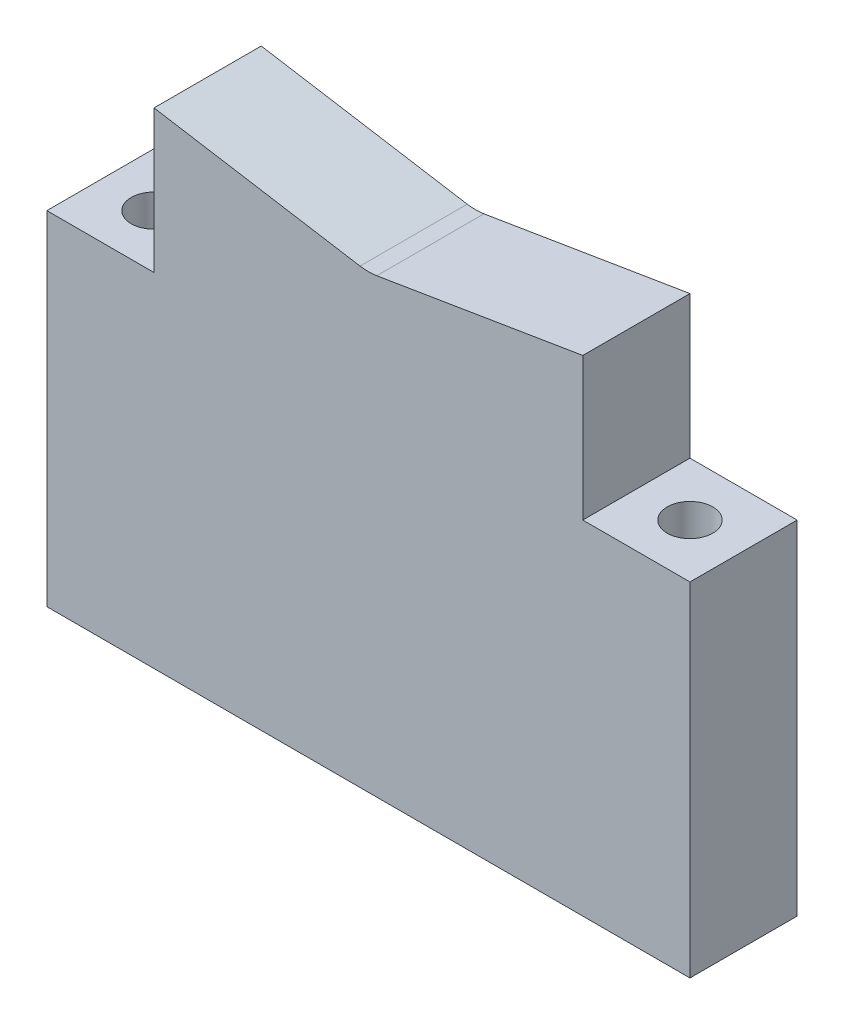
ISO-10303-21;
HEADER;
FILE_DESCRIPTION(('STEP AP214'),'2;1');
FILE_NAME('part.step','',(''),(''),'','','');
FILE_SCHEMA(('AUTOMOTIVE_DESIGN { 1 0 10303 214 1 1 1 1 }'));
ENDSEC;
DATA;
#1=APPLICATION_CONTEXT('core data for automotive mechanical design processes');
#2=APPLICATION_PROTOCOL_DEFINITION('international standard','automotive_design',2000,#1);
#3=PRODUCT_CONTEXT('',#1,'mechanical');
#4=PRODUCT('Part','Part','',(#3));
#5=PRODUCT_RELATED_PRODUCT_CATEGORY('part','',(#4));
#6=PRODUCT_DEFINITION_FORMATION('','',#4);
#7=PRODUCT_DEFINITION_CONTEXT('part definition',#1,'design');
#8=PRODUCT_DEFINITION('design','',#6,#7);
#9=PRODUCT_DEFINITION_SHAPE('','',#8);
#10=(LENGTH_UNIT() NAMED_UNIT(*) SI_UNIT(.MILLI.,.METRE.));
#11=(NAMED_UNIT(*) PLANE_ANGLE_UNIT() SI_UNIT($,.RADIAN.));
#12=(NAMED_UNIT(*) SI_UNIT($,.STERADIAN.) SOLID_ANGLE_UNIT());
#13=UNCERTAINTY_MEASURE_WITH_UNIT(LENGTH_MEASURE(1.E-05),#10,'distance_accuracy_value','');
#14=(GEOMETRIC_REPRESENTATION_CONTEXT(3) GLOBAL_UNCERTAINTY_ASSIGNED_CONTEXT((#13)) GLOBAL_UNIT_ASSIGNED_CONTEXT((#10,
#11,#12)) REPRESENTATION_CONTEXT('',''));
#15=CARTESIAN_POINT('',(0.,0.,0.));
#16=DIRECTION('',(0.,0.,1.));
#17=DIRECTION('',(1.,0.,0.));
#18=AXIS2_PLACEMENT_3D('',#15,#16,#17);
#19=CARTESIAN_POINT('',(31.75,0.,15.875));
#20=DIRECTION('',(1.,0.,0.));
#21=DIRECTION('',(0.,0.,-1.));
#22=AXIS2_PLACEMENT_3D('',#19,#20,#21);
#23=PLANE('',#22);
#24=DIRECTION('',(0.,-1.,0.));
#25=VECTOR('',#24,1.);
#26=CARTESIAN_POINT('',(31.75,0.,0.));
#27=LINE('',#26,#25);
#28=CARTESIAN_POINT('',(31.7500000000002,40.1622721729668,0.));
#29=VERTEX_POINT('',#28);
#30=CARTESIAN_POINT('',(31.75,19.05,0.));
#31=VERTEX_POINT('',#30);
#32=EDGE_CURVE('E123',#29,#31,#27,.T.);
#33=ORIENTED_EDGE('',*,*,#32,.F.);
#34=DIRECTION('',(0.,0.,-1.));
#35=VECTOR('',#34,1.);
#36=CARTESIAN_POINT('',(31.7500000000002,40.1622721729668,15.875));
#37=LINE('',#36,#35);
#38=CARTESIAN_POINT('',(31.7500000000002,40.1622721729668,15.875));
#39=VERTEX_POINT('',#38);
#40=EDGE_CURVE('E112',#39,#29,#37,.T.);
#41=ORIENTED_EDGE('',*,*,#40,.F.);
#42=DIRECTION('',(0.,-1.,0.));
#43=VECTOR('',#42,1.);
#44=CARTESIAN_POINT('',(31.75,0.,15.875));
#45=LINE('',#44,#43);
#46=CARTESIAN_POINT('',(31.75,19.05,15.875));
#47=VERTEX_POINT('',#46);
#48=EDGE_CURVE('E118',#39,#47,#45,.T.);
#49=ORIENTED_EDGE('',*,*,#48,.T.);
#50=DIRECTION('',(0.,0.,-1.));
#51=VECTOR('',#50,1.);
#52=CARTESIAN_POINT('',(31.75,19.05,15.875));
#53=LINE('',#52,#51);
#54=EDGE_CURVE('E156',#47,#31,#53,.T.);
#55=ORIENTED_EDGE('',*,*,#54,.T.);
#56=EDGE_LOOP('',(#33,#41,#49,#55));
#57=FACE_BOUND('',#56,.T.);
#58=ADVANCED_FACE('F36',(#57),#23,.T.);
#59=CARTESIAN_POINT('',(-5.60839691752582,33.9998755555556,15.875));
#60=DIRECTION('',(-0.162754074876448,0.986666666666667,0.));
#61=DIRECTION('',(-0.986666666666667,-0.162754074876448,0.));
#62=AXIS2_PLACEMENT_3D('',#59,#60,#61);
#63=PLANE('',#62);
#64=DIRECTION('',(0.986666666666667,0.162754074876448,0.));
#65=VECTOR('',#64,1.);
#66=CARTESIAN_POINT('',(-5.60839691752582,33.9998755555556,0.));
#67=LINE('',#66,#65);
#68=CARTESIAN_POINT('',(1.24018605055851,35.129572972973,0.));
#69=VERTEX_POINT('',#68);
#70=EDGE_CURVE('E158',#69,#29,#67,.T.);
#71=ORIENTED_EDGE('',*,*,#70,.F.);
#72=DIRECTION('',(0.,0.,-1.));
#73=VECTOR('',#72,1.);
#74=CARTESIAN_POINT('',(1.24018605055851,35.129572972973,15.875));
#75=LINE('',#74,#73);
#76=CARTESIAN_POINT('',(1.24018605055851,35.129572972973,15.875));
#77=VERTEX_POINT('',#76);
#78=EDGE_CURVE('E51',#69,#77,#75,.F.);
#79=ORIENTED_EDGE('',*,*,#78,.T.);
#80=DIRECTION('',(0.986666666666667,0.162754074876448,0.));
#81=VECTOR('',#80,1.);
#82=CARTESIAN_POINT('',(-5.60839691752582,33.9998755555556,15.875));
#83=LINE('',#82,#81);
#84=EDGE_CURVE('E109',#77,#39,#83,.T.);
#85=ORIENTED_EDGE('',*,*,#84,.T.);
#86=ORIENTED_EDGE('',*,*,#40,.T.);
#87=EDGE_LOOP('',(#71,#79,#85,#86));
#88=FACE_BOUND('',#87,.T.);
#89=ADVANCED_FACE('F111',(#88),#63,.T.);
#90=CARTESIAN_POINT('',(5.60839691752588,33.9998755555555,15.875));
#91=DIRECTION('',(0.16275407487645,0.986666666666667,0.));
#92=DIRECTION('',(-0.986666666666667,0.16275407487645,0.));
#93=AXIS2_PLACEMENT_3D('',#90,#91,#92);
#94=PLANE('',#93);
#95=DIRECTION('',(0.986666666666667,-0.16275407487645,0.));
#96=VECTOR('',#95,1.);
#97=CARTESIAN_POINT('',(5.60839691752588,33.9998755555555,15.875));
#98=LINE('',#97,#96);
#99=CARTESIAN_POINT('',(-31.7499999999998,40.1622721729668,15.875));
#100=VERTEX_POINT('',#99);
#101=CARTESIAN_POINT('',(-1.24018605055858,35.129572972973,15.875));
#102=VERTEX_POINT('',#101);
#103=EDGE_CURVE('E117',#100,#102,#98,.T.);
#104=ORIENTED_EDGE('',*,*,#103,.T.);
#105=DIRECTION('',(0.,0.,-1.));
#106=VECTOR('',#105,1.);
#107=CARTESIAN_POINT('',(-1.24018605055858,35.129572972973,0.));
#108=LINE('',#107,#106);
#109=CARTESIAN_POINT('',(-1.24018605055858,35.129572972973,0.));
#110=VERTEX_POINT('',#109);
#111=EDGE_CURVE('E124',#102,#110,#108,.T.);
#112=ORIENTED_EDGE('',*,*,#111,.T.);
#113=DIRECTION('',(0.986666666666667,-0.16275407487645,0.));
#114=VECTOR('',#113,1.);
#115=CARTESIAN_POINT('',(5.60839691752588,33.9998755555555,0.));
#116=LINE('',#115,#114);
#117=CARTESIAN_POINT('',(-31.7499999999998,40.1622721729668,0.));
#118=VERTEX_POINT('',#117);
#119=EDGE_CURVE('E160',#118,#110,#116,.T.);
#120=ORIENTED_EDGE('',*,*,#119,.F.);
#121=DIRECTION('',(0.,0.,-1.));
#122=VECTOR('',#121,1.);
#123=CARTESIAN_POINT('',(-31.7499999999998,40.1622721729668,15.875));
#124=LINE('',#123,#122);
#125=EDGE_CURVE('E125',#100,#118,#124,.T.);
#126=ORIENTED_EDGE('',*,*,#125,.F.);
#127=EDGE_LOOP('',(#104,#112,#120,#126));
#128=FACE_BOUND('',#127,.T.);
#129=ADVANCED_FACE('F203',(#128),#94,.T.);
#130=CARTESIAN_POINT('',(-31.75,0.,15.875));
#131=DIRECTION('',(1.,0.,0.));
#132=DIRECTION('',(0.,1.,0.));
#133=AXIS2_PLACEMENT_3D('',#130,#131,#132);
#134=PLANE('',#133);
#135=DIRECTION('',(0.,-1.,0.));
#136=VECTOR('',#135,1.);
#137=CARTESIAN_POINT('',(-31.75,0.,0.));
#138=LINE('',#137,#136);
#139=CARTESIAN_POINT('',(-31.75,19.05,0.));
#140=VERTEX_POINT('',#139);
#141=EDGE_CURVE('E162',#118,#140,#138,.T.);
#142=ORIENTED_EDGE('',*,*,#141,.T.);
#143=DIRECTION('',(0.,0.,-1.));
#144=VECTOR('',#143,1.);
#145=CARTESIAN_POINT('',(-31.75,19.05,15.875));
#146=LINE('',#145,#144);
#147=CARTESIAN_POINT('',(-31.75,19.05,15.875));
#148=VERTEX_POINT('',#147);
#149=EDGE_CURVE('E185',#148,#140,#146,.T.);
#150=ORIENTED_EDGE('',*,*,#149,.F.);
#151=DIRECTION('',(0.,-1.,0.));
#152=VECTOR('',#151,1.);
#153=CARTESIAN_POINT('',(-31.75,0.,15.875));
#154=LINE('',#153,#152);
#155=EDGE_CURVE('E142',#100,#148,#154,.T.);
#156=ORIENTED_EDGE('',*,*,#155,.F.);
#157=ORIENTED_EDGE('',*,*,#125,.T.);
#158=EDGE_LOOP('',(#142,#150,#156,#157));
#159=FACE_BOUND('',#158,.T.);
#160=ADVANCED_FACE('F211',(#159),#134,.F.);
#161=CARTESIAN_POINT('',(0.,19.05,15.875));
#162=DIRECTION('',(0.,1.,0.));
#163=DIRECTION('',(0.,0.,1.));
#164=AXIS2_PLACEMENT_3D('',#161,#162,#163);
#165=PLANE('',#164);
#166=CARTESIAN_POINT('',(-39.6875,19.05,7.9375));
#167=DIRECTION('',(0.,1.,0.));
#168=DIRECTION('',(0.,0.,1.));
#169=AXIS2_PLACEMENT_3D('',#166,#167,#168);
#170=CIRCLE('',#169,3.37819999999999);
#171=CARTESIAN_POINT('',(-39.6875,19.05,11.3157));
#172=VERTEX_POINT('',#171);
#173=EDGE_CURVE('E191',#172,#172,#170,.T.);
#174=ORIENTED_EDGE('',*,*,#173,.F.);
#175=EDGE_LOOP('',(#174));
#176=FACE_BOUND('',#175,.T.);
#177=DIRECTION('',(1.,0.,0.));
#178=VECTOR('',#177,1.);
#179=CARTESIAN_POINT('',(0.,19.05,0.));
#180=LINE('',#179,#178);
#181=CARTESIAN_POINT('',(-47.625,19.05,0.));
#182=VERTEX_POINT('',#181);
#183=EDGE_CURVE('E165',#182,#140,#180,.T.);
#184=ORIENTED_EDGE('',*,*,#183,.F.);
#185=DIRECTION('',(0.,0.,-1.));
#186=VECTOR('',#185,1.);
#187=CARTESIAN_POINT('',(-47.625,19.05,15.875));
#188=LINE('',#187,#186);
#189=CARTESIAN_POINT('',(-47.625,19.05,15.875));
#190=VERTEX_POINT('',#189);
#191=EDGE_CURVE('E183',#190,#182,#188,.T.);
#192=ORIENTED_EDGE('',*,*,#191,.F.);
#193=DIRECTION('',(1.,0.,0.));
#194=VECTOR('',#193,1.);
#195=CARTESIAN_POINT('',(0.,19.05,15.875));
#196=LINE('',#195,#194);
#197=EDGE_CURVE('E144',#190,#148,#196,.T.);
#198=ORIENTED_EDGE('',*,*,#197,.T.);
#199=ORIENTED_EDGE('',*,*,#149,.T.);
#200=EDGE_LOOP('',(#184,#192,#198,#199));
#201=FACE_BOUND('',#200,.T.);
#202=ADVANCED_FACE('F232',(#176,#201),#165,.T.);
#203=CARTESIAN_POINT('',(-47.625,0.,15.875));
#204=DIRECTION('',(-1.,0.,0.));
#205=DIRECTION('',(0.,0.,1.));
#206=AXIS2_PLACEMENT_3D('',#203,#204,#205);
#207=PLANE('',#206);
#208=DIRECTION('',(0.,1.,0.));
#209=VECTOR('',#208,1.);
#210=CARTESIAN_POINT('',(-47.625,0.,0.));
#211=LINE('',#210,#209);
#212=CARTESIAN_POINT('',(-47.625,-31.75,0.));
#213=VERTEX_POINT('',#212);
#214=EDGE_CURVE('E168',#213,#182,#211,.T.);
#215=ORIENTED_EDGE('',*,*,#214,.F.);
#216=DIRECTION('',(0.,0.,-1.));
#217=VECTOR('',#216,1.);
#218=CARTESIAN_POINT('',(-47.625,-31.75,15.875));
#219=LINE('',#218,#217);
#220=CARTESIAN_POINT('',(-47.625,-31.75,15.875));
#221=VERTEX_POINT('',#220);
#222=EDGE_CURVE('E181',#221,#213,#219,.T.);
#223=ORIENTED_EDGE('',*,*,#222,.F.);
#224=DIRECTION('',(0.,1.,0.));
#225=VECTOR('',#224,1.);
#226=CARTESIAN_POINT('',(-47.625,0.,15.875));
#227=LINE('',#226,#225);
#228=EDGE_CURVE('E147',#221,#190,#227,.T.);
#229=ORIENTED_EDGE('',*,*,#228,.T.);
#230=ORIENTED_EDGE('',*,*,#191,.T.);
#231=EDGE_LOOP('',(#215,#223,#229,#230));
#232=FACE_BOUND('',#231,.T.);
#233=ADVANCED_FACE('F235',(#232),#207,.T.);
#234=CARTESIAN_POINT('',(0.,-31.75,15.875));
#235=DIRECTION('',(0.,-1.,0.));
#236=DIRECTION('',(1.,0.,0.));
#237=AXIS2_PLACEMENT_3D('',#234,#235,#236);
#238=PLANE('',#237);
#239=CARTESIAN_POINT('',(39.6875,-31.75,7.93749999999999));
#240=DIRECTION('',(0.,-1.,0.));
#241=DIRECTION('',(0.,0.,-1.));
#242=AXIS2_PLACEMENT_3D('',#239,#240,#241);
#243=CIRCLE('',#242,5.715);
#244=CARTESIAN_POINT('',(39.6875,-31.75,2.22249999999999));
#245=VERTEX_POINT('',#244);
#246=EDGE_CURVE('E292',#245,#245,#243,.T.);
#247=ORIENTED_EDGE('',*,*,#246,.F.);
#248=EDGE_LOOP('',(#247));
#249=FACE_BOUND('',#248,.T.);
#250=CARTESIAN_POINT('',(-39.6875,-31.75,7.9375));
#251=DIRECTION('',(0.,-1.,0.));
#252=DIRECTION('',(0.,0.,-1.));
#253=AXIS2_PLACEMENT_3D('',#250,#251,#252);
#254=CIRCLE('',#253,5.715);
#255=CARTESIAN_POINT('',(-39.6875,-31.75,2.2225));
#256=VERTEX_POINT('',#255);
#257=EDGE_CURVE('E196',#256,#256,#254,.T.);
#258=ORIENTED_EDGE('',*,*,#257,.F.);
#259=EDGE_LOOP('',(#258));
#260=FACE_BOUND('',#259,.T.);
#261=DIRECTION('',(-1.,0.,0.));
#262=VECTOR('',#261,1.);
#263=CARTESIAN_POINT('',(0.,-31.75,0.));
#264=LINE('',#263,#262);
#265=CARTESIAN_POINT('',(47.625,-31.75,0.));
#266=VERTEX_POINT('',#265);
#267=EDGE_CURVE('E171',#266,#213,#264,.T.);
#268=ORIENTED_EDGE('',*,*,#267,.F.);
#269=DIRECTION('',(0.,0.,-1.));
#270=VECTOR('',#269,1.);
#271=CARTESIAN_POINT('',(47.625,-31.75,15.875));
#272=LINE('',#271,#270);
#273=CARTESIAN_POINT('',(47.625,-31.75,15.875));
#274=VERTEX_POINT('',#273);
#275=EDGE_CURVE('E179',#274,#266,#272,.T.);
#276=ORIENTED_EDGE('',*,*,#275,.F.);
#277=DIRECTION('',(-1.,0.,0.));
#278=VECTOR('',#277,1.);
#279=CARTESIAN_POINT('',(0.,-31.75,15.875));
#280=LINE('',#279,#278);
#281=EDGE_CURVE('E150',#274,#221,#280,.T.);
#282=ORIENTED_EDGE('',*,*,#281,.T.);
#283=ORIENTED_EDGE('',*,*,#222,.T.);
#284=EDGE_LOOP('',(#268,#276,#282,#283));
#285=FACE_BOUND('',#284,.T.);
#286=ADVANCED_FACE('F239',(#249,#260,#285),#238,.T.);
#287=CARTESIAN_POINT('',(47.625,0.,15.875));
#288=DIRECTION('',(-1.,0.,0.));
#289=DIRECTION('',(0.,-1.,0.));
#290=AXIS2_PLACEMENT_3D('',#287,#288,#289);
#291=PLANE('',#290);
#292=DIRECTION('',(0.,1.,0.));
#293=VECTOR('',#292,1.);
#294=CARTESIAN_POINT('',(47.625,0.,0.));
#295=LINE('',#294,#293);
#296=CARTESIAN_POINT('',(47.625,19.05,0.));
#297=VERTEX_POINT('',#296);
#298=EDGE_CURVE('E134',#266,#297,#295,.T.);
#299=ORIENTED_EDGE('',*,*,#298,.T.);
#300=DIRECTION('',(0.,0.,-1.));
#301=VECTOR('',#300,1.);
#302=CARTESIAN_POINT('',(47.625,19.05,15.875));
#303=LINE('',#302,#301);
#304=CARTESIAN_POINT('',(47.625,19.05,15.875));
#305=VERTEX_POINT('',#304);
#306=EDGE_CURVE('E176',#305,#297,#303,.T.);
#307=ORIENTED_EDGE('',*,*,#306,.F.);
#308=DIRECTION('',(0.,1.,0.));
#309=VECTOR('',#308,1.);
#310=CARTESIAN_POINT('',(47.625,0.,15.875));
#311=LINE('',#310,#309);
#312=EDGE_CURVE('E153',#274,#305,#311,.T.);
#313=ORIENTED_EDGE('',*,*,#312,.F.);
#314=ORIENTED_EDGE('',*,*,#275,.T.);
#315=EDGE_LOOP('',(#299,#307,#313,#314));
#316=FACE_BOUND('',#315,.T.);
#317=ADVANCED_FACE('F243',(#316),#291,.F.);
#318=CARTESIAN_POINT('',(0.,19.05,15.875));
#319=DIRECTION('',(0.,-1.,0.));
#320=DIRECTION('',(1.,0.,0.));
#321=AXIS2_PLACEMENT_3D('',#318,#319,#320);
#322=PLANE('',#321);
#323=CARTESIAN_POINT('',(39.6875,19.05,7.93749999999999));
#324=DIRECTION('',(0.,1.,0.));
#325=DIRECTION('',(0.,0.,1.));
#326=AXIS2_PLACEMENT_3D('',#323,#324,#325);
#327=CIRCLE('',#326,3.37819999999999);
#328=CARTESIAN_POINT('',(39.6875,19.05,11.3157));
#329=VERTEX_POINT('',#328);
#330=EDGE_CURVE('E137',#329,#329,#327,.T.);
#331=ORIENTED_EDGE('',*,*,#330,.F.);
#332=EDGE_LOOP('',(#331));
#333=FACE_BOUND('',#332,.T.);
#334=DIRECTION('',(-1.,0.,0.));
#335=VECTOR('',#334,1.);
#336=CARTESIAN_POINT('',(0.,19.05,0.));
#337=LINE('',#336,#335);
#338=EDGE_CURVE('E131',#297,#31,#337,.T.);
#339=ORIENTED_EDGE('',*,*,#338,.T.);
#340=ORIENTED_EDGE('',*,*,#54,.F.);
#341=DIRECTION('',(-1.,0.,0.));
#342=VECTOR('',#341,1.);
#343=CARTESIAN_POINT('',(0.,19.05,15.875));
#344=LINE('',#343,#342);
#345=EDGE_CURVE('E129',#305,#47,#344,.T.);
#346=ORIENTED_EDGE('',*,*,#345,.F.);
#347=ORIENTED_EDGE('',*,*,#306,.T.);
#348=EDGE_LOOP('',(#339,#340,#346,#347));
#349=FACE_BOUND('',#348,.T.);
#350=ADVANCED_FACE('F247',(#333,#349),#322,.F.);
#351=CARTESIAN_POINT('',(0.,0.,15.875));
#352=DIRECTION('',(0.,0.,1.));
#353=DIRECTION('',(1.,0.,0.));
#354=AXIS2_PLACEMENT_3D('',#351,#352,#353);
#355=PLANE('',#354);
#356=ORIENTED_EDGE('',*,*,#48,.F.);
#357=ORIENTED_EDGE('',*,*,#84,.F.);
#358=CARTESIAN_POINT('',(0.,42.647972972973,15.875));
#359=DIRECTION('',(0.,0.,1.));
#360=DIRECTION('',(1.,0.,0.));
#361=AXIS2_PLACEMENT_3D('',#358,#359,#360);
#362=CIRCLE('',#361,7.62);
#363=EDGE_CURVE('E11',#77,#102,#362,.F.);
#364=ORIENTED_EDGE('',*,*,#363,.T.);
#365=ORIENTED_EDGE('',*,*,#103,.F.);
#366=ORIENTED_EDGE('',*,*,#155,.T.);
#367=ORIENTED_EDGE('',*,*,#197,.F.);
#368=ORIENTED_EDGE('',*,*,#228,.F.);
#369=ORIENTED_EDGE('',*,*,#281,.F.);
#370=ORIENTED_EDGE('',*,*,#312,.T.);
#371=ORIENTED_EDGE('',*,*,#345,.T.);
#372=EDGE_LOOP('',(#356,#357,#364,#365,#366,#367,#368,#369,#370,#371));
#373=FACE_BOUND('',#372,.T.);
#374=ADVANCED_FACE('F127',(#373),#355,.T.);
#375=CARTESIAN_POINT('',(0.,0.,0.));
#376=DIRECTION('',(0.,0.,1.));
#377=DIRECTION('',(1.,0.,0.));
#378=AXIS2_PLACEMENT_3D('',#375,#376,#377);
#379=PLANE('',#378);
#380=ORIENTED_EDGE('',*,*,#32,.T.);
#381=ORIENTED_EDGE('',*,*,#338,.F.);
#382=ORIENTED_EDGE('',*,*,#298,.F.);
#383=ORIENTED_EDGE('',*,*,#267,.T.);
#384=ORIENTED_EDGE('',*,*,#214,.T.);
#385=ORIENTED_EDGE('',*,*,#183,.T.);
#386=ORIENTED_EDGE('',*,*,#141,.F.);
#387=ORIENTED_EDGE('',*,*,#119,.T.);
#388=CARTESIAN_POINT('',(0.,42.647972972973,0.));
#389=DIRECTION('',(0.,0.,1.));
#390=DIRECTION('',(1.,0.,0.));
#391=AXIS2_PLACEMENT_3D('',#388,#389,#390);
#392=CIRCLE('',#391,7.62);
#393=EDGE_CURVE('E44',#110,#69,#392,.T.);
#394=ORIENTED_EDGE('',*,*,#393,.T.);
#395=ORIENTED_EDGE('',*,*,#70,.T.);
#396=EDGE_LOOP('',(#380,#381,#382,#383,#384,#385,#386,#387,#394,#395));
#397=FACE_BOUND('',#396,.T.);
#398=ADVANCED_FACE('F207',(#397),#379,.F.);
#399=CARTESIAN_POINT('',(39.6875,19.05,7.93749999999999));
#400=DIRECTION('',(0.,1.,0.));
#401=DIRECTION('',(0.,0.,1.));
#402=AXIS2_PLACEMENT_3D('',#399,#400,#401);
#403=CYLINDRICAL_SURFACE('',#402,3.37819999999999);
#404=CARTESIAN_POINT('',(39.6875,1.6256,7.93749999999999));
#405=DIRECTION('',(0.,1.,0.));
#406=DIRECTION('',(0.,0.,1.));
#407=AXIS2_PLACEMENT_3D('',#404,#405,#406);
#408=CIRCLE('',#407,3.37819999999999);
#409=CARTESIAN_POINT('',(39.6875,1.6256,11.3157));
#410=VERTEX_POINT('',#409);
#411=EDGE_CURVE('E193',#410,#410,#408,.F.);
#412=ORIENTED_EDGE('',*,*,#411,.T.);
#413=EDGE_LOOP('',(#412));
#414=FACE_BOUND('',#413,.T.);
#415=ORIENTED_EDGE('',*,*,#330,.T.);
#416=EDGE_LOOP('',(#415));
#417=FACE_BOUND('',#416,.T.);
#418=ADVANCED_FACE('F254',(#414,#417),#403,.F.);
#419=CARTESIAN_POINT('',(-39.6875,19.05,7.9375));
#420=DIRECTION('',(0.,1.,0.));
#421=DIRECTION('',(0.,0.,1.));
#422=AXIS2_PLACEMENT_3D('',#419,#420,#421);
#423=CYLINDRICAL_SURFACE('',#422,3.37819999999999);
#424=CARTESIAN_POINT('',(-39.6875,1.62559999999998,7.9375));
#425=DIRECTION('',(0.,1.,0.));
#426=DIRECTION('',(0.,0.,1.));
#427=AXIS2_PLACEMENT_3D('',#424,#425,#426);
#428=CIRCLE('',#427,3.37819999999999);
#429=CARTESIAN_POINT('',(-39.6875,1.62559999999998,11.3157));
#430=VERTEX_POINT('',#429);
#431=EDGE_CURVE('E188',#430,#430,#428,.F.);
#432=ORIENTED_EDGE('',*,*,#431,.T.);
#433=EDGE_LOOP('',(#432));
#434=FACE_BOUND('',#433,.T.);
#435=ORIENTED_EDGE('',*,*,#173,.T.);
#436=EDGE_LOOP('',(#435));
#437=FACE_BOUND('',#436,.T.);
#438=ADVANCED_FACE('F259',(#434,#437),#423,.F.);
#439=CARTESIAN_POINT('',(-39.6875,1.62559999999998,7.9375));
#440=DIRECTION('',(0.,1.,0.));
#441=DIRECTION('',(0.,0.,1.));
#442=AXIS2_PLACEMENT_3D('',#439,#440,#441);
#443=PLANE('',#442);
#444=CARTESIAN_POINT('',(-39.6875,1.62559999999998,7.9375));
#445=DIRECTION('',(0.,-1.,0.));
#446=DIRECTION('',(0.,0.,-1.));
#447=AXIS2_PLACEMENT_3D('',#444,#445,#446);
#448=CIRCLE('',#447,5.71499999999999);
#449=CARTESIAN_POINT('',(-39.6875,1.62559999999998,2.22250000000001));
#450=VERTEX_POINT('',#449);
#451=EDGE_CURVE('E192',#450,#450,#448,.T.);
#452=ORIENTED_EDGE('',*,*,#451,.T.);
#453=EDGE_LOOP('',(#452));
#454=FACE_BOUND('',#453,.T.);
#455=ORIENTED_EDGE('',*,*,#431,.F.);
#456=EDGE_LOOP('',(#455));
#457=FACE_BOUND('',#456,.T.);
#458=ADVANCED_FACE('F263',(#454,#457),#443,.F.);
#459=CARTESIAN_POINT('',(-39.6875,-31.75,7.9375));
#460=DIRECTION('',(0.,-1.,0.));
#461=DIRECTION('',(0.,0.,-1.));
#462=AXIS2_PLACEMENT_3D('',#459,#460,#461);
#463=CYLINDRICAL_SURFACE('',#462,5.71499999999999);
#464=ORIENTED_EDGE('',*,*,#451,.F.);
#465=EDGE_LOOP('',(#464));
#466=FACE_BOUND('',#465,.T.);
#467=ORIENTED_EDGE('',*,*,#257,.T.);
#468=EDGE_LOOP('',(#467));
#469=FACE_BOUND('',#468,.T.);
#470=ADVANCED_FACE('F267',(#466,#469),#463,.F.);
#471=CARTESIAN_POINT('',(39.6875,1.6256,7.93749999999999));
#472=DIRECTION('',(0.,1.,0.));
#473=DIRECTION('',(0.,0.,1.));
#474=AXIS2_PLACEMENT_3D('',#471,#472,#473);
#475=PLANE('',#474);
#476=CARTESIAN_POINT('',(39.6875,1.6256,7.93749999999999));
#477=DIRECTION('',(0.,-1.,0.));
#478=DIRECTION('',(0.,0.,-1.));
#479=AXIS2_PLACEMENT_3D('',#476,#477,#478);
#480=CIRCLE('',#479,5.71499999999999);
#481=CARTESIAN_POINT('',(39.6875,1.6256,2.2225));
#482=VERTEX_POINT('',#481);
#483=EDGE_CURVE('E197',#482,#482,#480,.T.);
#484=ORIENTED_EDGE('',*,*,#483,.T.);
#485=EDGE_LOOP('',(#484));
#486=FACE_BOUND('',#485,.T.);
#487=ORIENTED_EDGE('',*,*,#411,.F.);
#488=EDGE_LOOP('',(#487));
#489=FACE_BOUND('',#488,.T.);
#490=ADVANCED_FACE('F219',(#486,#489),#475,.F.);
#491=CARTESIAN_POINT('',(39.6875,-31.75,7.93749999999999));
#492=DIRECTION('',(0.,-1.,0.));
#493=DIRECTION('',(0.,0.,-1.));
#494=AXIS2_PLACEMENT_3D('',#491,#492,#493);
#495=CYLINDRICAL_SURFACE('',#494,5.71499999999999);
#496=ORIENTED_EDGE('',*,*,#483,.F.);
#497=EDGE_LOOP('',(#496));
#498=FACE_BOUND('',#497,.T.);
#499=ORIENTED_EDGE('',*,*,#246,.T.);
#500=EDGE_LOOP('',(#499));
#501=FACE_BOUND('',#500,.T.);
#502=ADVANCED_FACE('F215',(#498,#501),#495,.F.);
#503=CARTESIAN_POINT('',(0.,42.647972972973,15.875));
#504=DIRECTION('',(0.,0.,1.));
#505=DIRECTION('',(1.,0.,0.));
#506=AXIS2_PLACEMENT_3D('',#503,#504,#505);
#507=CYLINDRICAL_SURFACE('',#506,7.62);
#508=ORIENTED_EDGE('',*,*,#363,.F.);
#509=ORIENTED_EDGE('',*,*,#78,.F.);
#510=ORIENTED_EDGE('',*,*,#393,.F.);
#511=ORIENTED_EDGE('',*,*,#111,.F.);
#512=EDGE_LOOP('',(#508,#509,#510,#511));
#513=FACE_BOUND('',#512,.T.);
#514=ADVANCED_FACE('F38',(#513),#507,.F.);
#515=CLOSED_SHELL('',(#58,#89,#129,#160,#202,#233,#286,#317,#350,#374,#398,#418,#438,#458,#470,
#490,#502,#514));
#516=MANIFOLD_SOLID_BREP('B2',#515);
#517=ADVANCED_BREP_SHAPE_REPRESENTATION('',(#18,#516),#14);
#518=SHAPE_DEFINITION_REPRESENTATION(#9,#517);
ENDSEC;
END-ISO-10303-21;
